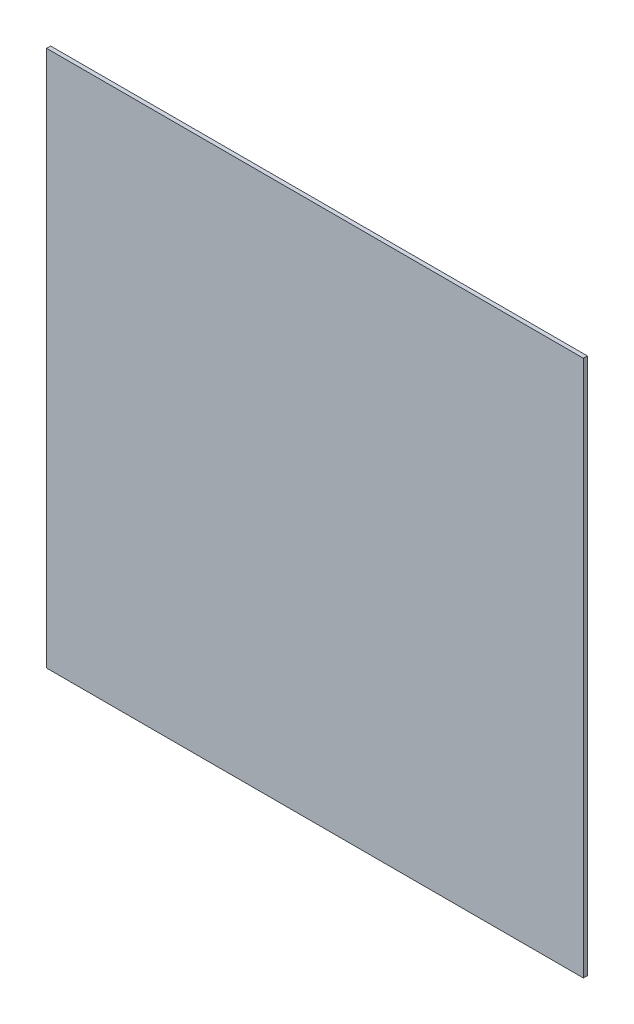
ISO-10303-21;
HEADER;
FILE_DESCRIPTION(('STEP AP214'),'2;1');
FILE_NAME('part.step','',(''),(''),'','','');
FILE_SCHEMA(('AUTOMOTIVE_DESIGN { 1 0 10303 214 1 1 1 1 }'));
ENDSEC;
DATA;
#1=APPLICATION_CONTEXT('core data for automotive mechanical design processes');
#2=APPLICATION_PROTOCOL_DEFINITION('international standard','automotive_design',2000,#1);
#3=PRODUCT_CONTEXT('',#1,'mechanical');
#4=PRODUCT('Part','Part','',(#3));
#5=PRODUCT_RELATED_PRODUCT_CATEGORY('part','',(#4));
#6=PRODUCT_DEFINITION_FORMATION('','',#4);
#7=PRODUCT_DEFINITION_CONTEXT('part definition',#1,'design');
#8=PRODUCT_DEFINITION('design','',#6,#7);
#9=PRODUCT_DEFINITION_SHAPE('','',#8);
#10=(LENGTH_UNIT() NAMED_UNIT(*) SI_UNIT(.MILLI.,.METRE.));
#11=(NAMED_UNIT(*) PLANE_ANGLE_UNIT() SI_UNIT($,.RADIAN.));
#12=(NAMED_UNIT(*) SI_UNIT($,.STERADIAN.) SOLID_ANGLE_UNIT());
#13=UNCERTAINTY_MEASURE_WITH_UNIT(LENGTH_MEASURE(1.E-05),#10,'distance_accuracy_value','');
#14=(GEOMETRIC_REPRESENTATION_CONTEXT(3) GLOBAL_UNCERTAINTY_ASSIGNED_CONTEXT((#13)) GLOBAL_UNIT_ASSIGNED_CONTEXT((#10,
#11,#12)) REPRESENTATION_CONTEXT('',''));
#15=CARTESIAN_POINT('',(0.,0.,0.));
#16=DIRECTION('',(0.,0.,1.));
#17=DIRECTION('',(1.,0.,0.));
#18=AXIS2_PLACEMENT_3D('',#15,#16,#17);
#19=CARTESIAN_POINT('',(0.,0.,-15.));
#20=DIRECTION('',(-1.,0.,0.));
#21=DIRECTION('',(0.,-1.,0.));
#22=AXIS2_PLACEMENT_3D('',#19,#20,#21);
#23=PLANE('',#22);
#24=DIRECTION('',(0.,-1.,0.));
#25=VECTOR('',#24,1.);
#26=CARTESIAN_POINT('',(0.,0.,0.));
#27=LINE('',#26,#25);
#28=CARTESIAN_POINT('',(0.,0.,0.));
#29=VERTEX_POINT('',#28);
#30=CARTESIAN_POINT('',(2.44929359829471E-13,-2000.,0.));
#31=VERTEX_POINT('',#30);
#32=EDGE_CURVE('E102',#29,#31,#27,.T.);
#33=ORIENTED_EDGE('',*,*,#32,.F.);
#34=DIRECTION('',(0.,0.,1.));
#35=VECTOR('',#34,1.);
#36=CARTESIAN_POINT('',(0.,0.,-15.));
#37=LINE('',#36,#35);
#38=CARTESIAN_POINT('',(0.,0.,-15.));
#39=VERTEX_POINT('',#38);
#40=EDGE_CURVE('E11',#39,#29,#37,.T.);
#41=ORIENTED_EDGE('',*,*,#40,.F.);
#42=DIRECTION('',(0.,-1.,0.));
#43=VECTOR('',#42,1.);
#44=CARTESIAN_POINT('',(0.,0.,-15.));
#45=LINE('',#44,#43);
#46=CARTESIAN_POINT('',(2.44929359829471E-13,-2000.,-15.));
#47=VERTEX_POINT('',#46);
#48=EDGE_CURVE('E96',#39,#47,#45,.T.);
#49=ORIENTED_EDGE('',*,*,#48,.T.);
#50=DIRECTION('',(0.,0.,1.));
#51=VECTOR('',#50,1.);
#52=CARTESIAN_POINT('',(2.44929359829471E-13,-2000.,-15.));
#53=LINE('',#52,#51);
#54=EDGE_CURVE('E41',#47,#31,#53,.T.);
#55=ORIENTED_EDGE('',*,*,#54,.T.);
#56=EDGE_LOOP('',(#33,#41,#49,#55));
#57=FACE_BOUND('',#56,.T.);
#58=ADVANCED_FACE('F38',(#57),#23,.T.);
#59=CARTESIAN_POINT('',(0.,0.,-15.));
#60=DIRECTION('',(0.,1.,0.));
#61=DIRECTION('',(0.,0.,1.));
#62=AXIS2_PLACEMENT_3D('',#59,#60,#61);
#63=PLANE('',#62);
#64=DIRECTION('',(-1.,0.,0.));
#65=VECTOR('',#64,1.);
#66=CARTESIAN_POINT('',(0.,0.,0.));
#67=LINE('',#66,#65);
#68=CARTESIAN_POINT('',(2000.,0.,0.));
#69=VERTEX_POINT('',#68);
#70=EDGE_CURVE('E98',#69,#29,#67,.T.);
#71=ORIENTED_EDGE('',*,*,#70,.F.);
#72=DIRECTION('',(0.,0.,1.));
#73=VECTOR('',#72,1.);
#74=CARTESIAN_POINT('',(2000.,0.,-15.));
#75=LINE('',#74,#73);
#76=CARTESIAN_POINT('',(2000.,0.,-15.));
#77=VERTEX_POINT('',#76);
#78=EDGE_CURVE('E47',#77,#69,#75,.T.);
#79=ORIENTED_EDGE('',*,*,#78,.F.);
#80=DIRECTION('',(-1.,0.,0.));
#81=VECTOR('',#80,1.);
#82=CARTESIAN_POINT('',(0.,0.,-15.));
#83=LINE('',#82,#81);
#84=EDGE_CURVE('E93',#77,#39,#83,.T.);
#85=ORIENTED_EDGE('',*,*,#84,.T.);
#86=ORIENTED_EDGE('',*,*,#40,.T.);
#87=EDGE_LOOP('',(#71,#79,#85,#86));
#88=FACE_BOUND('',#87,.T.);
#89=ADVANCED_FACE('F112',(#88),#63,.T.);
#90=CARTESIAN_POINT('',(2000.,0.,-15.));
#91=DIRECTION('',(1.,0.,0.));
#92=DIRECTION('',(0.,1.,0.));
#93=AXIS2_PLACEMENT_3D('',#90,#91,#92);
#94=PLANE('',#93);
#95=DIRECTION('',(0.,1.,0.));
#96=VECTOR('',#95,1.);
#97=CARTESIAN_POINT('',(2000.,0.,0.));
#98=LINE('',#97,#96);
#99=CARTESIAN_POINT('',(2000.,-2000.,0.));
#100=VERTEX_POINT('',#99);
#101=EDGE_CURVE('E88',#100,#69,#98,.T.);
#102=ORIENTED_EDGE('',*,*,#101,.F.);
#103=DIRECTION('',(0.,0.,1.));
#104=VECTOR('',#103,1.);
#105=CARTESIAN_POINT('',(2000.,-2000.,-15.));
#106=LINE('',#105,#104);
#107=CARTESIAN_POINT('',(2000.,-2000.,-15.));
#108=VERTEX_POINT('',#107);
#109=EDGE_CURVE('E83',#108,#100,#106,.T.);
#110=ORIENTED_EDGE('',*,*,#109,.F.);
#111=DIRECTION('',(0.,1.,0.));
#112=VECTOR('',#111,1.);
#113=CARTESIAN_POINT('',(2000.,0.,-15.));
#114=LINE('',#113,#112);
#115=EDGE_CURVE('E86',#108,#77,#114,.T.);
#116=ORIENTED_EDGE('',*,*,#115,.T.);
#117=ORIENTED_EDGE('',*,*,#78,.T.);
#118=EDGE_LOOP('',(#102,#110,#116,#117));
#119=FACE_BOUND('',#118,.T.);
#120=ADVANCED_FACE('F85',(#119),#94,.T.);
#121=CARTESIAN_POINT('',(2.44929359829471E-13,-2000.,-15.));
#122=DIRECTION('',(0.,-1.,0.));
#123=DIRECTION('',(0.,0.,-1.));
#124=AXIS2_PLACEMENT_3D('',#121,#122,#123);
#125=PLANE('',#124);
#126=DIRECTION('',(1.,0.,0.));
#127=VECTOR('',#126,1.);
#128=CARTESIAN_POINT('',(2.44929359829471E-13,-2000.,0.));
#129=LINE('',#128,#127);
#130=EDGE_CURVE('E105',#31,#100,#129,.T.);
#131=ORIENTED_EDGE('',*,*,#130,.F.);
#132=ORIENTED_EDGE('',*,*,#54,.F.);
#133=DIRECTION('',(1.,0.,0.));
#134=VECTOR('',#133,1.);
#135=CARTESIAN_POINT('',(2.44929359829471E-13,-2000.,-15.));
#136=LINE('',#135,#134);
#137=EDGE_CURVE('E92',#47,#108,#136,.T.);
#138=ORIENTED_EDGE('',*,*,#137,.T.);
#139=ORIENTED_EDGE('',*,*,#109,.T.);
#140=EDGE_LOOP('',(#131,#132,#138,#139));
#141=FACE_BOUND('',#140,.T.);
#142=ADVANCED_FACE('F95',(#141),#125,.T.);
#143=CARTESIAN_POINT('',(0.,0.,-15.));
#144=DIRECTION('',(0.,0.,1.));
#145=DIRECTION('',(1.,0.,0.));
#146=AXIS2_PLACEMENT_3D('',#143,#144,#145);
#147=PLANE('',#146);
#148=ORIENTED_EDGE('',*,*,#48,.F.);
#149=ORIENTED_EDGE('',*,*,#84,.F.);
#150=ORIENTED_EDGE('',*,*,#115,.F.);
#151=ORIENTED_EDGE('',*,*,#137,.F.);
#152=EDGE_LOOP('',(#148,#149,#150,#151));
#153=FACE_BOUND('',#152,.T.);
#154=ADVANCED_FACE('F91',(#153),#147,.F.);
#155=CARTESIAN_POINT('',(0.,0.,0.));
#156=DIRECTION('',(0.,0.,1.));
#157=DIRECTION('',(1.,0.,0.));
#158=AXIS2_PLACEMENT_3D('',#155,#156,#157);
#159=PLANE('',#158);
#160=ORIENTED_EDGE('',*,*,#32,.T.);
#161=ORIENTED_EDGE('',*,*,#130,.T.);
#162=ORIENTED_EDGE('',*,*,#101,.T.);
#163=ORIENTED_EDGE('',*,*,#70,.T.);
#164=EDGE_LOOP('',(#160,#161,#162,#163));
#165=FACE_BOUND('',#164,.T.);
#166=ADVANCED_FACE('F111',(#165),#159,.T.);
#167=CLOSED_SHELL('',(#58,#89,#120,#142,#154,#166));
#168=MANIFOLD_SOLID_BREP('B2',#167);
#169=ADVANCED_BREP_SHAPE_REPRESENTATION('',(#18,#168),#14);
#170=SHAPE_DEFINITION_REPRESENTATION(#9,#169);
ENDSEC;
END-ISO-10303-21;
